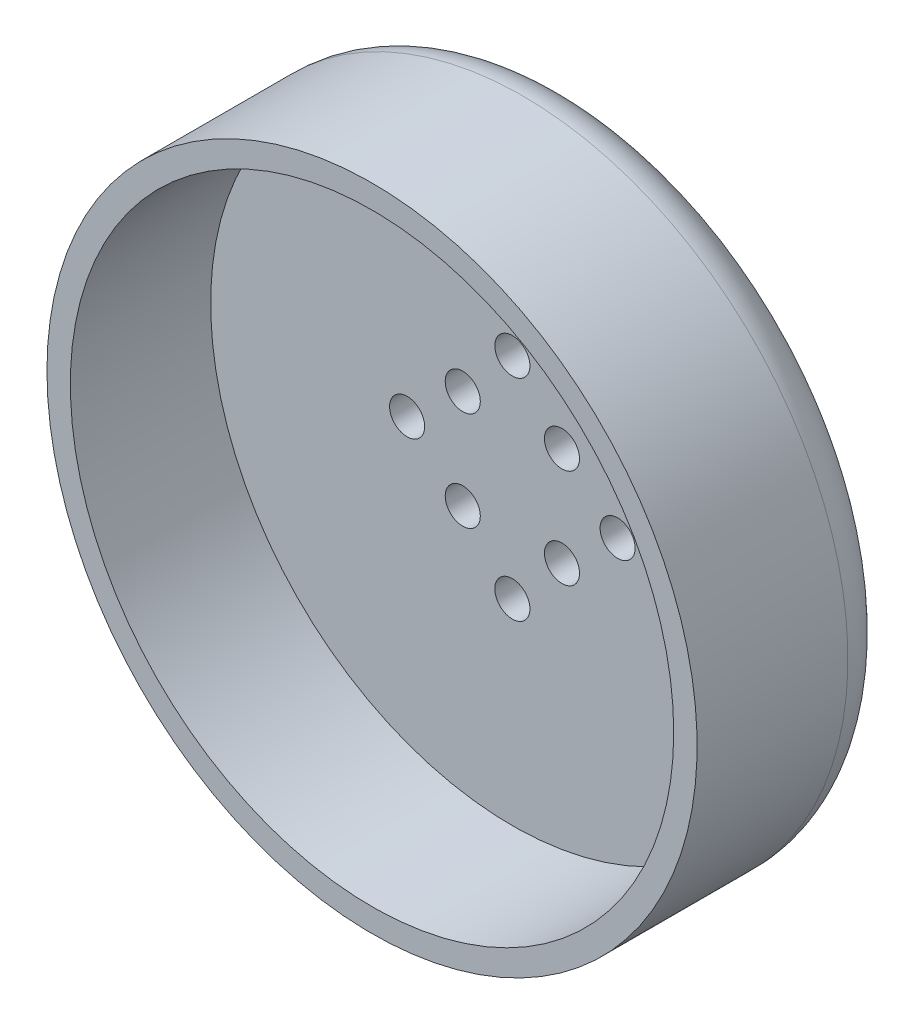
ISO-10303-21;
HEADER;
FILE_DESCRIPTION(('STEP AP214'),'2;1');
FILE_NAME('part.step','',(''),(''),'','','');
FILE_SCHEMA(('AUTOMOTIVE_DESIGN { 1 0 10303 214 1 1 1 1 }'));
ENDSEC;
DATA;
#1=APPLICATION_CONTEXT('core data for automotive mechanical design processes');
#2=APPLICATION_PROTOCOL_DEFINITION('international standard','automotive_design',2000,#1);
#3=PRODUCT_CONTEXT('',#1,'mechanical');
#4=PRODUCT('Part','Part','',(#3));
#5=PRODUCT_RELATED_PRODUCT_CATEGORY('part','',(#4));
#6=PRODUCT_DEFINITION_FORMATION('','',#4);
#7=PRODUCT_DEFINITION_CONTEXT('part definition',#1,'design');
#8=PRODUCT_DEFINITION('design','',#6,#7);
#9=PRODUCT_DEFINITION_SHAPE('','',#8);
#10=(LENGTH_UNIT() NAMED_UNIT(*) SI_UNIT(.MILLI.,.METRE.));
#11=(NAMED_UNIT(*) PLANE_ANGLE_UNIT() SI_UNIT($,.RADIAN.));
#12=(NAMED_UNIT(*) SI_UNIT($,.STERADIAN.) SOLID_ANGLE_UNIT());
#13=UNCERTAINTY_MEASURE_WITH_UNIT(LENGTH_MEASURE(1.E-05),#10,'distance_accuracy_value','');
#14=(GEOMETRIC_REPRESENTATION_CONTEXT(3) GLOBAL_UNCERTAINTY_ASSIGNED_CONTEXT((#13)) GLOBAL_UNIT_ASSIGNED_CONTEXT((#10,
#11,#12)) REPRESENTATION_CONTEXT('',''));
#15=CARTESIAN_POINT('',(0.,0.,0.));
#16=DIRECTION('',(0.,0.,1.));
#17=DIRECTION('',(1.,0.,0.));
#18=AXIS2_PLACEMENT_3D('',#15,#16,#17);
#19=CARTESIAN_POINT('',(-4.24264068711929,4.24264068711928,-8.24999999999999));
#20=DIRECTION('',(0.,0.,-1.));
#21=DIRECTION('',(-1.,0.,0.));
#22=AXIS2_PLACEMENT_3D('',#19,#20,#21);
#23=CYLINDRICAL_SURFACE('',#22,1.5);
#24=CARTESIAN_POINT('',(-4.24264068711929,4.24264068711928,-27.));
#25=DIRECTION('',(0.,0.,-1.));
#26=DIRECTION('',(-1.,0.,0.));
#27=AXIS2_PLACEMENT_3D('',#24,#25,#26);
#28=CIRCLE('',#27,1.5);
#29=CARTESIAN_POINT('',(-5.74264068711929,4.24264068711928,-27.));
#30=VERTEX_POINT('',#29);
#31=EDGE_CURVE('E60',#30,#30,#28,.T.);
#32=ORIENTED_EDGE('',*,*,#31,.T.);
#33=EDGE_LOOP('',(#32));
#34=FACE_BOUND('',#33,.T.);
#35=CARTESIAN_POINT('',(-4.24264068711929,4.24264068711928,-20.25));
#36=DIRECTION('',(0.,0.,1.));
#37=DIRECTION('',(1.,0.,0.));
#38=AXIS2_PLACEMENT_3D('',#35,#36,#37);
#39=CIRCLE('',#38,1.5);
#40=CARTESIAN_POINT('',(-2.74264068711929,4.24264068711928,-20.25));
#41=VERTEX_POINT('',#40);
#42=EDGE_CURVE('E70',#41,#41,#39,.F.);
#43=ORIENTED_EDGE('',*,*,#42,.F.);
#44=EDGE_LOOP('',(#43));
#45=FACE_BOUND('',#44,.T.);
#46=ADVANCED_FACE('F33',(#34,#45),#23,.F.);
#47=CARTESIAN_POINT('',(0.,9.,-8.24999999999999));
#48=DIRECTION('',(0.,0.,-1.));
#49=DIRECTION('',(-1.,0.,0.));
#50=AXIS2_PLACEMENT_3D('',#47,#48,#49);
#51=CYLINDRICAL_SURFACE('',#50,1.5);
#52=CARTESIAN_POINT('',(0.,9.,-27.));
#53=DIRECTION('',(0.,0.,-1.));
#54=DIRECTION('',(-1.,0.,0.));
#55=AXIS2_PLACEMENT_3D('',#52,#53,#54);
#56=CIRCLE('',#55,1.5);
#57=CARTESIAN_POINT('',(-1.5,9.,-27.));
#58=VERTEX_POINT('',#57);
#59=EDGE_CURVE('E59',#58,#58,#56,.T.);
#60=ORIENTED_EDGE('',*,*,#59,.T.);
#61=EDGE_LOOP('',(#60));
#62=FACE_BOUND('',#61,.T.);
#63=CARTESIAN_POINT('',(0.,9.,-20.25));
#64=DIRECTION('',(0.,0.,1.));
#65=DIRECTION('',(1.,0.,0.));
#66=AXIS2_PLACEMENT_3D('',#63,#64,#65);
#67=CIRCLE('',#66,1.5);
#68=CARTESIAN_POINT('',(1.5,9.,-20.25));
#69=VERTEX_POINT('',#68);
#70=EDGE_CURVE('E86',#69,#69,#67,.F.);
#71=ORIENTED_EDGE('',*,*,#70,.F.);
#72=EDGE_LOOP('',(#71));
#73=FACE_BOUND('',#72,.T.);
#74=ADVANCED_FACE('F135',(#62,#73),#51,.F.);
#75=CARTESIAN_POINT('',(4.24264068711923,4.24264068711934,-8.24999999999999));
#76=DIRECTION('',(0.,0.,-1.));
#77=DIRECTION('',(-1.,0.,0.));
#78=AXIS2_PLACEMENT_3D('',#75,#76,#77);
#79=CYLINDRICAL_SURFACE('',#78,1.5);
#80=CARTESIAN_POINT('',(4.24264068711923,4.24264068711934,-27.));
#81=DIRECTION('',(0.,0.,-1.));
#82=DIRECTION('',(0.,1.,0.));
#83=AXIS2_PLACEMENT_3D('',#80,#81,#82);
#84=CIRCLE('',#83,1.5);
#85=CARTESIAN_POINT('',(4.24264068711922,5.74264068711934,-27.));
#86=VERTEX_POINT('',#85);
#87=EDGE_CURVE('E66',#86,#86,#84,.T.);
#88=ORIENTED_EDGE('',*,*,#87,.T.);
#89=EDGE_LOOP('',(#88));
#90=FACE_BOUND('',#89,.T.);
#91=CARTESIAN_POINT('',(4.24264068711923,4.24264068711934,-20.25));
#92=DIRECTION('',(0.,0.,1.));
#93=DIRECTION('',(1.,0.,0.));
#94=AXIS2_PLACEMENT_3D('',#91,#92,#93);
#95=CIRCLE('',#94,1.5);
#96=CARTESIAN_POINT('',(5.74264068711923,4.24264068711934,-20.25));
#97=VERTEX_POINT('',#96);
#98=EDGE_CURVE('E89',#97,#97,#95,.F.);
#99=ORIENTED_EDGE('',*,*,#98,.F.);
#100=EDGE_LOOP('',(#99));
#101=FACE_BOUND('',#100,.T.);
#102=ADVANCED_FACE('F141',(#90,#101),#79,.F.);
#103=CARTESIAN_POINT('',(9.,0.,-8.24999999999999));
#104=DIRECTION('',(0.,0.,-1.));
#105=DIRECTION('',(-1.,0.,0.));
#106=AXIS2_PLACEMENT_3D('',#103,#104,#105);
#107=CYLINDRICAL_SURFACE('',#106,1.5);
#108=CARTESIAN_POINT('',(9.,0.,-27.));
#109=DIRECTION('',(0.,0.,-1.));
#110=DIRECTION('',(0.,1.,0.));
#111=AXIS2_PLACEMENT_3D('',#108,#109,#110);
#112=CIRCLE('',#111,1.5);
#113=CARTESIAN_POINT('',(8.99999999999998,1.50000000000009,-27.));
#114=VERTEX_POINT('',#113);
#115=EDGE_CURVE('E69',#114,#114,#112,.T.);
#116=ORIENTED_EDGE('',*,*,#115,.T.);
#117=EDGE_LOOP('',(#116));
#118=FACE_BOUND('',#117,.T.);
#119=CARTESIAN_POINT('',(9.,0.,-20.25));
#120=DIRECTION('',(0.,0.,1.));
#121=DIRECTION('',(1.,0.,0.));
#122=AXIS2_PLACEMENT_3D('',#119,#120,#121);
#123=CIRCLE('',#122,1.5);
#124=CARTESIAN_POINT('',(10.5,0.,-20.25));
#125=VERTEX_POINT('',#124);
#126=EDGE_CURVE('E92',#125,#125,#123,.F.);
#127=ORIENTED_EDGE('',*,*,#126,.F.);
#128=EDGE_LOOP('',(#127));
#129=FACE_BOUND('',#128,.T.);
#130=ADVANCED_FACE('F254',(#118,#129),#107,.F.);
#131=CARTESIAN_POINT('',(4.24264068711929,-4.24264068711928,-8.24999999999999));
#132=DIRECTION('',(0.,0.,-1.));
#133=DIRECTION('',(-1.,0.,0.));
#134=AXIS2_PLACEMENT_3D('',#131,#132,#133);
#135=CYLINDRICAL_SURFACE('',#134,1.5);
#136=CARTESIAN_POINT('',(4.24264068711929,-4.24264068711928,-27.));
#137=DIRECTION('',(0.,0.,-1.));
#138=DIRECTION('',(1.,0.,0.));
#139=AXIS2_PLACEMENT_3D('',#136,#137,#138);
#140=CIRCLE('',#139,1.5);
#141=CARTESIAN_POINT('',(5.74264068711929,-4.24264068711928,-27.));
#142=VERTEX_POINT('',#141);
#143=EDGE_CURVE('E73',#142,#142,#140,.T.);
#144=ORIENTED_EDGE('',*,*,#143,.T.);
#145=EDGE_LOOP('',(#144));
#146=FACE_BOUND('',#145,.T.);
#147=CARTESIAN_POINT('',(4.24264068711929,-4.24264068711928,-20.25));
#148=DIRECTION('',(0.,0.,1.));
#149=DIRECTION('',(1.,0.,0.));
#150=AXIS2_PLACEMENT_3D('',#147,#148,#149);
#151=CIRCLE('',#150,1.5);
#152=CARTESIAN_POINT('',(5.74264068711929,-4.24264068711928,-20.25));
#153=VERTEX_POINT('',#152);
#154=EDGE_CURVE('E95',#153,#153,#151,.F.);
#155=ORIENTED_EDGE('',*,*,#154,.F.);
#156=EDGE_LOOP('',(#155));
#157=FACE_BOUND('',#156,.T.);
#158=ADVANCED_FACE('F244',(#146,#157),#135,.F.);
#159=CARTESIAN_POINT('',(0.,-9.,-8.24999999999999));
#160=DIRECTION('',(0.,0.,-1.));
#161=DIRECTION('',(-1.,0.,0.));
#162=AXIS2_PLACEMENT_3D('',#159,#160,#161);
#163=CYLINDRICAL_SURFACE('',#162,1.5);
#164=CARTESIAN_POINT('',(0.,-9.,-27.));
#165=DIRECTION('',(0.,0.,-1.));
#166=DIRECTION('',(1.,0.,0.));
#167=AXIS2_PLACEMENT_3D('',#164,#165,#166);
#168=CIRCLE('',#167,1.5);
#169=CARTESIAN_POINT('',(1.5,-9.,-27.));
#170=VERTEX_POINT('',#169);
#171=EDGE_CURVE('E76',#170,#170,#168,.T.);
#172=ORIENTED_EDGE('',*,*,#171,.T.);
#173=EDGE_LOOP('',(#172));
#174=FACE_BOUND('',#173,.T.);
#175=CARTESIAN_POINT('',(0.,-9.,-20.25));
#176=DIRECTION('',(0.,0.,1.));
#177=DIRECTION('',(1.,0.,0.));
#178=AXIS2_PLACEMENT_3D('',#175,#176,#177);
#179=CIRCLE('',#178,1.5);
#180=CARTESIAN_POINT('',(1.5,-9.,-20.25));
#181=VERTEX_POINT('',#180);
#182=EDGE_CURVE('E98',#181,#181,#179,.F.);
#183=ORIENTED_EDGE('',*,*,#182,.F.);
#184=EDGE_LOOP('',(#183));
#185=FACE_BOUND('',#184,.T.);
#186=ADVANCED_FACE('F130',(#174,#185),#163,.F.);
#187=CARTESIAN_POINT('',(-4.24264068711926,-4.24264068711931,-8.24999999999999));
#188=DIRECTION('',(0.,0.,-1.));
#189=DIRECTION('',(-1.,0.,0.));
#190=AXIS2_PLACEMENT_3D('',#187,#188,#189);
#191=CYLINDRICAL_SURFACE('',#190,1.5);
#192=CARTESIAN_POINT('',(-4.24264068711926,-4.24264068711931,-27.));
#193=DIRECTION('',(0.,0.,-1.));
#194=DIRECTION('',(0.,-1.,0.));
#195=AXIS2_PLACEMENT_3D('',#192,#193,#194);
#196=CIRCLE('',#195,1.5);
#197=CARTESIAN_POINT('',(-4.24264068711926,-5.74264068711931,-27.));
#198=VERTEX_POINT('',#197);
#199=EDGE_CURVE('E79',#198,#198,#196,.T.);
#200=ORIENTED_EDGE('',*,*,#199,.T.);
#201=EDGE_LOOP('',(#200));
#202=FACE_BOUND('',#201,.T.);
#203=CARTESIAN_POINT('',(-4.24264068711926,-4.24264068711931,-20.25));
#204=DIRECTION('',(0.,0.,1.));
#205=DIRECTION('',(1.,0.,0.));
#206=AXIS2_PLACEMENT_3D('',#203,#204,#205);
#207=CIRCLE('',#206,1.5);
#208=CARTESIAN_POINT('',(-2.74264068711926,-4.24264068711931,-20.25));
#209=VERTEX_POINT('',#208);
#210=EDGE_CURVE('E101',#209,#209,#207,.F.);
#211=ORIENTED_EDGE('',*,*,#210,.F.);
#212=EDGE_LOOP('',(#211));
#213=FACE_BOUND('',#212,.T.);
#214=ADVANCED_FACE('F120',(#202,#213),#191,.F.);
#215=CARTESIAN_POINT('',(-9.,0.,-8.24999999999999));
#216=DIRECTION('',(0.,0.,-1.));
#217=DIRECTION('',(-1.,0.,0.));
#218=AXIS2_PLACEMENT_3D('',#215,#216,#217);
#219=CYLINDRICAL_SURFACE('',#218,1.5);
#220=CARTESIAN_POINT('',(-9.,0.,-27.));
#221=DIRECTION('',(0.,0.,-1.));
#222=DIRECTION('',(0.,-1.,0.));
#223=AXIS2_PLACEMENT_3D('',#220,#221,#222);
#224=CIRCLE('',#223,1.5);
#225=CARTESIAN_POINT('',(-8.99999999999999,-1.50000000000003,-27.));
#226=VERTEX_POINT('',#225);
#227=EDGE_CURVE('E63',#226,#226,#224,.T.);
#228=ORIENTED_EDGE('',*,*,#227,.T.);
#229=EDGE_LOOP('',(#228));
#230=FACE_BOUND('',#229,.T.);
#231=CARTESIAN_POINT('',(-9.,0.,-20.25));
#232=DIRECTION('',(0.,0.,1.));
#233=DIRECTION('',(1.,0.,0.));
#234=AXIS2_PLACEMENT_3D('',#231,#232,#233);
#235=CIRCLE('',#234,1.5);
#236=CARTESIAN_POINT('',(-7.5,0.,-20.25));
#237=VERTEX_POINT('',#236);
#238=EDGE_CURVE('E37',#237,#237,#235,.F.);
#239=ORIENTED_EDGE('',*,*,#238,.F.);
#240=EDGE_LOOP('',(#239));
#241=FACE_BOUND('',#240,.T.);
#242=ADVANCED_FACE('F117',(#230,#241),#219,.F.);
#243=CARTESIAN_POINT('',(0.,0.,-32.));
#244=DIRECTION('',(0.,0.,-1.));
#245=DIRECTION('',(-1.,0.,0.));
#246=AXIS2_PLACEMENT_3D('',#243,#244,#245);
#247=PLANE('',#246);
#248=CARTESIAN_POINT('',(0.,0.,-32.));
#249=DIRECTION('',(0.,0.,-1.));
#250=DIRECTION('',(-1.,0.,0.));
#251=AXIS2_PLACEMENT_3D('',#248,#249,#250);
#252=CIRCLE('',#251,2.);
#253=CARTESIAN_POINT('',(-2.,0.,-32.));
#254=VERTEX_POINT('',#253);
#255=EDGE_CURVE('E50',#254,#254,#252,.T.);
#256=ORIENTED_EDGE('',*,*,#255,.T.);
#257=EDGE_LOOP('',(#256));
#258=FACE_BOUND('',#257,.T.);
#259=ADVANCED_FACE('F119',(#258),#247,.T.);
#260=CARTESIAN_POINT('',(0.,0.,-88.99));
#261=DIRECTION('',(0.,0.,-1.));
#262=DIRECTION('',(-1.,0.,0.));
#263=AXIS2_PLACEMENT_3D('',#260,#261,#262);
#264=CYLINDRICAL_SURFACE('',#263,2.);
#265=CARTESIAN_POINT('',(0.,0.,-27.));
#266=DIRECTION('',(0.,0.,-1.));
#267=DIRECTION('',(-1.,0.,0.));
#268=AXIS2_PLACEMENT_3D('',#265,#266,#267);
#269=CIRCLE('',#268,2.);
#270=CARTESIAN_POINT('',(-2.,0.,-27.));
#271=VERTEX_POINT('',#270);
#272=EDGE_CURVE('E53',#271,#271,#269,.T.);
#273=ORIENTED_EDGE('',*,*,#272,.T.);
#274=EDGE_LOOP('',(#273));
#275=FACE_BOUND('',#274,.T.);
#276=ORIENTED_EDGE('',*,*,#255,.F.);
#277=EDGE_LOOP('',(#276));
#278=FACE_BOUND('',#277,.T.);
#279=ADVANCED_FACE('F127',(#275,#278),#264,.T.);
#280=CARTESIAN_POINT('',(-2.,0.,-27.));
#281=DIRECTION('',(0.,0.,-1.));
#282=DIRECTION('',(-1.,0.,0.));
#283=AXIS2_PLACEMENT_3D('',#280,#281,#282);
#284=PLANE('',#283);
#285=CARTESIAN_POINT('',(0.,0.,-27.));
#286=DIRECTION('',(0.,0.,-1.));
#287=DIRECTION('',(-1.,0.,0.));
#288=AXIS2_PLACEMENT_3D('',#285,#286,#287);
#289=CIRCLE('',#288,13.6217954509558);
#290=CARTESIAN_POINT('',(-13.6217954509558,0.,-27.));
#291=VERTEX_POINT('',#290);
#292=EDGE_CURVE('E45',#291,#291,#289,.T.);
#293=ORIENTED_EDGE('',*,*,#292,.T.);
#294=EDGE_LOOP('',(#293));
#295=FACE_BOUND('',#294,.T.);
#296=ORIENTED_EDGE('',*,*,#227,.F.);
#297=EDGE_LOOP('',(#296));
#298=FACE_BOUND('',#297,.T.);
#299=ORIENTED_EDGE('',*,*,#199,.F.);
#300=EDGE_LOOP('',(#299));
#301=FACE_BOUND('',#300,.T.);
#302=ORIENTED_EDGE('',*,*,#171,.F.);
#303=EDGE_LOOP('',(#302));
#304=FACE_BOUND('',#303,.T.);
#305=ORIENTED_EDGE('',*,*,#143,.F.);
#306=EDGE_LOOP('',(#305));
#307=FACE_BOUND('',#306,.T.);
#308=ORIENTED_EDGE('',*,*,#115,.F.);
#309=EDGE_LOOP('',(#308));
#310=FACE_BOUND('',#309,.T.);
#311=ORIENTED_EDGE('',*,*,#87,.F.);
#312=EDGE_LOOP('',(#311));
#313=FACE_BOUND('',#312,.T.);
#314=ORIENTED_EDGE('',*,*,#59,.F.);
#315=EDGE_LOOP('',(#314));
#316=FACE_BOUND('',#315,.T.);
#317=ORIENTED_EDGE('',*,*,#31,.F.);
#318=EDGE_LOOP('',(#317));
#319=FACE_BOUND('',#318,.T.);
#320=ORIENTED_EDGE('',*,*,#272,.F.);
#321=EDGE_LOOP('',(#320));
#322=FACE_BOUND('',#321,.T.);
#323=ADVANCED_FACE('F155',(#295,#298,#301,#304,#307,#310,#313,#316,#319,#322),#284,.T.);
#324=CARTESIAN_POINT('',(0.,0.,-88.99));
#325=DIRECTION('',(0.,0.,-1.));
#326=DIRECTION('',(-1.,0.,0.));
#327=AXIS2_PLACEMENT_3D('',#324,#325,#326);
#328=CYLINDRICAL_SURFACE('',#327,27.8);
#329=CARTESIAN_POINT('',(0.,0.,-21.1436014752909));
#330=DIRECTION('',(0.,0.,-1.));
#331=DIRECTION('',(-1.,0.,0.));
#332=AXIS2_PLACEMENT_3D('',#329,#330,#331);
#333=CIRCLE('',#332,27.8);
#334=CARTESIAN_POINT('',(-27.8,0.,-21.1436014752909));
#335=VERTEX_POINT('',#334);
#336=EDGE_CURVE('E41',#335,#335,#333,.F.);
#337=ORIENTED_EDGE('',*,*,#336,.T.);
#338=EDGE_LOOP('',(#337));
#339=FACE_BOUND('',#338,.T.);
#340=CARTESIAN_POINT('',(0.,0.,-8.24999999999999));
#341=DIRECTION('',(0.,0.,-1.));
#342=DIRECTION('',(-1.,0.,0.));
#343=AXIS2_PLACEMENT_3D('',#340,#341,#342);
#344=CIRCLE('',#343,27.8);
#345=CARTESIAN_POINT('',(-27.8,0.,-8.24999999999999));
#346=VERTEX_POINT('',#345);
#347=EDGE_CURVE('E56',#346,#346,#344,.T.);
#348=ORIENTED_EDGE('',*,*,#347,.T.);
#349=EDGE_LOOP('',(#348));
#350=FACE_BOUND('',#349,.T.);
#351=ADVANCED_FACE('F151',(#339,#350),#328,.T.);
#352=CARTESIAN_POINT('',(-27.8,0.,-8.25));
#353=DIRECTION('',(0.,0.,1.));
#354=DIRECTION('',(1.,0.,0.));
#355=AXIS2_PLACEMENT_3D('',#352,#353,#354);
#356=PLANE('',#355);
#357=CARTESIAN_POINT('',(0.,0.,-8.25));
#358=DIRECTION('',(0.,0.,1.));
#359=DIRECTION('',(1.,0.,0.));
#360=AXIS2_PLACEMENT_3D('',#357,#358,#359);
#361=CIRCLE('',#360,25.8);
#362=CARTESIAN_POINT('',(25.8,0.,-8.25));
#363=VERTEX_POINT('',#362);
#364=EDGE_CURVE('E104',#363,#363,#361,.T.);
#365=ORIENTED_EDGE('',*,*,#364,.F.);
#366=EDGE_LOOP('',(#365));
#367=FACE_BOUND('',#366,.T.);
#368=ORIENTED_EDGE('',*,*,#347,.F.);
#369=EDGE_LOOP('',(#368));
#370=FACE_BOUND('',#369,.T.);
#371=ADVANCED_FACE('F147',(#367,#370),#356,.T.);
#372=CARTESIAN_POINT('',(0.,0.,-27.));
#373=DIRECTION('',(0.,0.,1.));
#374=DIRECTION('',(1.,0.,0.));
#375=AXIS2_PLACEMENT_3D('',#372,#373,#374);
#376=CONICAL_SURFACE('',#375,13.6217954509558,1.39626340159546);
#377=CARTESIAN_POINT('',(0.,0.,-25.0828324873397));
#378=DIRECTION('',(0.,0.,-1.));
#379=DIRECTION('',(-1.,0.,0.));
#380=AXIS2_PLACEMENT_3D('',#377,#378,#379);
#381=CIRCLE('',#380,24.4945927106677);
#382=CARTESIAN_POINT('',(-24.4945927106677,0.,-25.0828324873397));
#383=VERTEX_POINT('',#382);
#384=EDGE_CURVE('E10',#383,#383,#381,.T.);
#385=ORIENTED_EDGE('',*,*,#384,.T.);
#386=EDGE_LOOP('',(#385));
#387=FACE_BOUND('',#386,.T.);
#388=ORIENTED_EDGE('',*,*,#292,.F.);
#389=EDGE_LOOP('',(#388));
#390=FACE_BOUND('',#389,.T.);
#391=ADVANCED_FACE('F150',(#387,#390),#376,.T.);
#392=CARTESIAN_POINT('',(0.,0.,-21.1436014752909));
#393=DIRECTION('',(0.,0.,-1.));
#394=DIRECTION('',(-1.,0.,0.));
#395=AXIS2_PLACEMENT_3D('',#392,#393,#394);
#396=TOROIDAL_SURFACE('',#395,23.8,4.);
#397=ORIENTED_EDGE('',*,*,#384,.F.);
#398=EDGE_LOOP('',(#397));
#399=FACE_BOUND('',#398,.T.);
#400=ORIENTED_EDGE('',*,*,#336,.F.);
#401=EDGE_LOOP('',(#400));
#402=FACE_BOUND('',#401,.T.);
#403=ADVANCED_FACE('F35',(#399,#402),#396,.T.);
#404=CARTESIAN_POINT('',(0.,0.,-20.25));
#405=DIRECTION('',(0.,0.,1.));
#406=DIRECTION('',(1.,0.,0.));
#407=AXIS2_PLACEMENT_3D('',#404,#405,#406);
#408=PLANE('',#407);
#409=CARTESIAN_POINT('',(0.,0.,-20.25));
#410=DIRECTION('',(0.,0.,1.));
#411=DIRECTION('',(1.,0.,0.));
#412=AXIS2_PLACEMENT_3D('',#409,#410,#411);
#413=CIRCLE('',#412,25.8);
#414=CARTESIAN_POINT('',(25.8,0.,-20.25));
#415=VERTEX_POINT('',#414);
#416=EDGE_CURVE('E107',#415,#415,#413,.T.);
#417=ORIENTED_EDGE('',*,*,#416,.T.);
#418=EDGE_LOOP('',(#417));
#419=FACE_BOUND('',#418,.T.);
#420=ORIENTED_EDGE('',*,*,#238,.T.);
#421=EDGE_LOOP('',(#420));
#422=FACE_BOUND('',#421,.T.);
#423=ORIENTED_EDGE('',*,*,#210,.T.);
#424=EDGE_LOOP('',(#423));
#425=FACE_BOUND('',#424,.T.);
#426=ORIENTED_EDGE('',*,*,#182,.T.);
#427=EDGE_LOOP('',(#426));
#428=FACE_BOUND('',#427,.T.);
#429=ORIENTED_EDGE('',*,*,#154,.T.);
#430=EDGE_LOOP('',(#429));
#431=FACE_BOUND('',#430,.T.);
#432=ORIENTED_EDGE('',*,*,#126,.T.);
#433=EDGE_LOOP('',(#432));
#434=FACE_BOUND('',#433,.T.);
#435=ORIENTED_EDGE('',*,*,#98,.T.);
#436=EDGE_LOOP('',(#435));
#437=FACE_BOUND('',#436,.T.);
#438=ORIENTED_EDGE('',*,*,#70,.T.);
#439=EDGE_LOOP('',(#438));
#440=FACE_BOUND('',#439,.T.);
#441=ORIENTED_EDGE('',*,*,#42,.T.);
#442=EDGE_LOOP('',(#441));
#443=FACE_BOUND('',#442,.T.);
#444=ADVANCED_FACE('F114',(#419,#422,#425,#428,#431,#434,#437,#440,#443),#408,.T.);
#445=CARTESIAN_POINT('',(0.,0.,-20.25));
#446=DIRECTION('',(0.,0.,1.));
#447=DIRECTION('',(1.,0.,0.));
#448=AXIS2_PLACEMENT_3D('',#445,#446,#447);
#449=CYLINDRICAL_SURFACE('',#448,25.8);
#450=ORIENTED_EDGE('',*,*,#416,.F.);
#451=EDGE_LOOP('',(#450));
#452=FACE_BOUND('',#451,.T.);
#453=ORIENTED_EDGE('',*,*,#364,.T.);
#454=EDGE_LOOP('',(#453));
#455=FACE_BOUND('',#454,.T.);
#456=ADVANCED_FACE('F197',(#452,#455),#449,.F.);
#457=CLOSED_SHELL('',(#46,#74,#102,#130,#158,#186,#214,#242,#259,#279,#323,#351,#371,#391,#403,
#444,#456));
#458=MANIFOLD_SOLID_BREP('B2',#457);
#459=ADVANCED_BREP_SHAPE_REPRESENTATION('',(#18,#458),#14);
#460=SHAPE_DEFINITION_REPRESENTATION(#9,#459);
ENDSEC;
END-ISO-10303-21;
